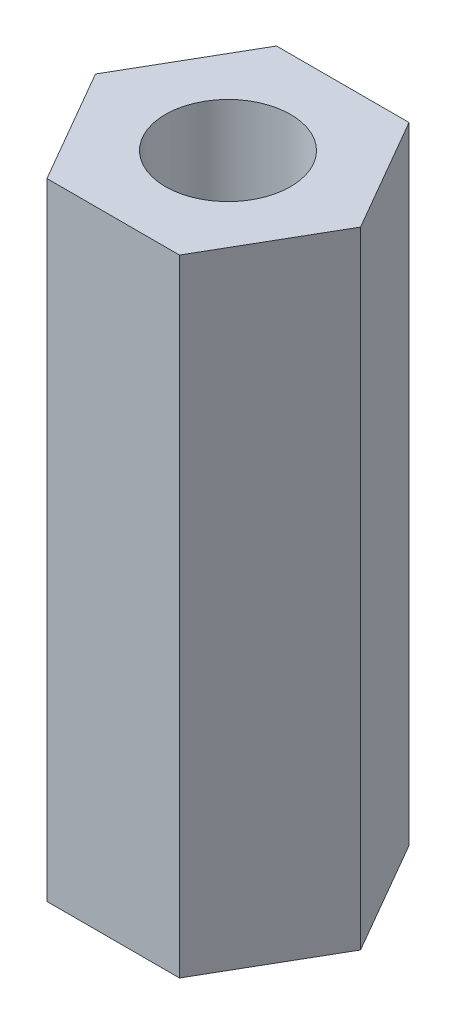
ISO-10303-21;
HEADER;
FILE_DESCRIPTION(('STEP AP214'),'2;1');
FILE_NAME('part.step','',(''),(''),'','','');
FILE_SCHEMA(('AUTOMOTIVE_DESIGN { 1 0 10303 214 1 1 1 1 }'));
ENDSEC;
DATA;
#1=APPLICATION_CONTEXT('core data for automotive mechanical design processes');
#2=APPLICATION_PROTOCOL_DEFINITION('international standard','automotive_design',2000,#1);
#3=PRODUCT_CONTEXT('',#1,'mechanical');
#4=PRODUCT('Part','Part','',(#3));
#5=PRODUCT_RELATED_PRODUCT_CATEGORY('part','',(#4));
#6=PRODUCT_DEFINITION_FORMATION('','',#4);
#7=PRODUCT_DEFINITION_CONTEXT('part definition',#1,'design');
#8=PRODUCT_DEFINITION('design','',#6,#7);
#9=PRODUCT_DEFINITION_SHAPE('','',#8);
#10=(LENGTH_UNIT() NAMED_UNIT(*) SI_UNIT(.MILLI.,.METRE.));
#11=(NAMED_UNIT(*) PLANE_ANGLE_UNIT() SI_UNIT($,.RADIAN.));
#12=(NAMED_UNIT(*) SI_UNIT($,.STERADIAN.) SOLID_ANGLE_UNIT());
#13=UNCERTAINTY_MEASURE_WITH_UNIT(LENGTH_MEASURE(1.E-05),#10,'distance_accuracy_value','');
#14=(GEOMETRIC_REPRESENTATION_CONTEXT(3) GLOBAL_UNCERTAINTY_ASSIGNED_CONTEXT((#13)) GLOBAL_UNIT_ASSIGNED_CONTEXT((#10,
#11,#12)) REPRESENTATION_CONTEXT('',''));
#15=CARTESIAN_POINT('',(0.,0.,0.));
#16=DIRECTION('',(0.,0.,1.));
#17=DIRECTION('',(1.,0.,0.));
#18=AXIS2_PLACEMENT_3D('',#15,#16,#17);
#19=CARTESIAN_POINT('',(0.,15.,0.));
#20=DIRECTION('',(0.,1.,0.));
#21=DIRECTION('',(0.,0.,1.));
#22=AXIS2_PLACEMENT_3D('',#19,#20,#21);
#23=PLANE('',#22);
#24=DIRECTION('',(-1.,0.,0.));
#25=VECTOR('',#24,1.);
#26=CARTESIAN_POINT('',(1.58771324027147,15.,-2.75));
#27=LINE('',#26,#25);
#28=CARTESIAN_POINT('',(1.58771324027147,15.,-2.75));
#29=VERTEX_POINT('',#28);
#30=CARTESIAN_POINT('',(-1.58771324027147,15.,-2.75));
#31=VERTEX_POINT('',#30);
#32=EDGE_CURVE('E133',#29,#31,#27,.T.);
#33=ORIENTED_EDGE('',*,*,#32,.T.);
#34=DIRECTION('',(-0.5,0.,0.866025403784438));
#35=VECTOR('',#34,1.);
#36=CARTESIAN_POINT('',(-1.58771324027147,15.,-2.75));
#37=LINE('',#36,#35);
#38=CARTESIAN_POINT('',(-3.17542648054294,15.,0.));
#39=VERTEX_POINT('',#38);
#40=EDGE_CURVE('E91',#31,#39,#37,.T.);
#41=ORIENTED_EDGE('',*,*,#40,.T.);
#42=DIRECTION('',(0.5,0.,0.866025403784439));
#43=VECTOR('',#42,1.);
#44=CARTESIAN_POINT('',(-3.17542648054294,15.,0.));
#45=LINE('',#44,#43);
#46=CARTESIAN_POINT('',(-1.58771324027147,15.,2.75));
#47=VERTEX_POINT('',#46);
#48=EDGE_CURVE('E104',#39,#47,#45,.T.);
#49=ORIENTED_EDGE('',*,*,#48,.T.);
#50=DIRECTION('',(1.,0.,0.));
#51=VECTOR('',#50,1.);
#52=CARTESIAN_POINT('',(-1.58771324027147,15.,2.75));
#53=LINE('',#52,#51);
#54=CARTESIAN_POINT('',(1.58771324027147,15.,2.75));
#55=VERTEX_POINT('',#54);
#56=EDGE_CURVE('E98',#47,#55,#53,.T.);
#57=ORIENTED_EDGE('',*,*,#56,.T.);
#58=DIRECTION('',(0.5,0.,-0.866025403784439));
#59=VECTOR('',#58,1.);
#60=CARTESIAN_POINT('',(1.58771324027147,15.,2.75));
#61=LINE('',#60,#59);
#62=CARTESIAN_POINT('',(3.17542648054294,15.,0.));
#63=VERTEX_POINT('',#62);
#64=EDGE_CURVE('E102',#55,#63,#61,.T.);
#65=ORIENTED_EDGE('',*,*,#64,.T.);
#66=DIRECTION('',(-0.5,0.,-0.866025403784439));
#67=VECTOR('',#66,1.);
#68=CARTESIAN_POINT('',(3.17542648054294,15.,0.));
#69=LINE('',#68,#67);
#70=EDGE_CURVE('E54',#63,#29,#69,.T.);
#71=ORIENTED_EDGE('',*,*,#70,.T.);
#72=EDGE_LOOP('',(#33,#41,#49,#57,#65,#71));
#73=FACE_BOUND('',#72,.T.);
#74=CARTESIAN_POINT('',(0.,15.,0.));
#75=DIRECTION('',(0.,1.,0.));
#76=DIRECTION('',(0.,0.,1.));
#77=AXIS2_PLACEMENT_3D('',#74,#75,#76);
#78=CIRCLE('',#77,1.5);
#79=CARTESIAN_POINT('',(0.,15.,1.5));
#80=VERTEX_POINT('',#79);
#81=EDGE_CURVE('E126',#80,#80,#78,.T.);
#82=ORIENTED_EDGE('',*,*,#81,.F.);
#83=EDGE_LOOP('',(#82));
#84=FACE_BOUND('',#83,.T.);
#85=ADVANCED_FACE('F37',(#73,#84),#23,.T.);
#86=CARTESIAN_POINT('',(0.,0.,0.));
#87=DIRECTION('',(0.,1.,0.));
#88=DIRECTION('',(0.,0.,1.));
#89=AXIS2_PLACEMENT_3D('',#86,#87,#88);
#90=PLANE('',#89);
#91=DIRECTION('',(-1.,0.,0.));
#92=VECTOR('',#91,1.);
#93=CARTESIAN_POINT('',(1.58771324027147,0.,-2.75));
#94=LINE('',#93,#92);
#95=CARTESIAN_POINT('',(1.58771324027147,0.,-2.75));
#96=VERTEX_POINT('',#95);
#97=CARTESIAN_POINT('',(-1.58771324027147,0.,-2.75));
#98=VERTEX_POINT('',#97);
#99=EDGE_CURVE('E122',#96,#98,#94,.T.);
#100=ORIENTED_EDGE('',*,*,#99,.F.);
#101=DIRECTION('',(-0.5,0.,-0.866025403784439));
#102=VECTOR('',#101,1.);
#103=CARTESIAN_POINT('',(3.17542648054294,0.,0.));
#104=LINE('',#103,#102);
#105=CARTESIAN_POINT('',(3.17542648054294,0.,0.));
#106=VERTEX_POINT('',#105);
#107=EDGE_CURVE('E83',#106,#96,#104,.T.);
#108=ORIENTED_EDGE('',*,*,#107,.F.);
#109=DIRECTION('',(0.5,0.,-0.866025403784439));
#110=VECTOR('',#109,1.);
#111=CARTESIAN_POINT('',(1.58771324027147,0.,2.75));
#112=LINE('',#111,#110);
#113=CARTESIAN_POINT('',(1.58771324027147,0.,2.75));
#114=VERTEX_POINT('',#113);
#115=EDGE_CURVE('E77',#114,#106,#112,.T.);
#116=ORIENTED_EDGE('',*,*,#115,.F.);
#117=DIRECTION('',(1.,0.,0.));
#118=VECTOR('',#117,1.);
#119=CARTESIAN_POINT('',(-1.58771324027147,0.,2.75));
#120=LINE('',#119,#118);
#121=CARTESIAN_POINT('',(-1.58771324027147,0.,2.75));
#122=VERTEX_POINT('',#121);
#123=EDGE_CURVE('E112',#122,#114,#120,.T.);
#124=ORIENTED_EDGE('',*,*,#123,.F.);
#125=DIRECTION('',(0.5,0.,0.866025403784439));
#126=VECTOR('',#125,1.);
#127=CARTESIAN_POINT('',(-3.17542648054294,0.,0.));
#128=LINE('',#127,#126);
#129=CARTESIAN_POINT('',(-3.17542648054294,0.,0.));
#130=VERTEX_POINT('',#129);
#131=EDGE_CURVE('E128',#130,#122,#128,.T.);
#132=ORIENTED_EDGE('',*,*,#131,.F.);
#133=DIRECTION('',(-0.5,0.,0.866025403784438));
#134=VECTOR('',#133,1.);
#135=CARTESIAN_POINT('',(-1.58771324027147,0.,-2.75));
#136=LINE('',#135,#134);
#137=EDGE_CURVE('E125',#98,#130,#136,.T.);
#138=ORIENTED_EDGE('',*,*,#137,.F.);
#139=EDGE_LOOP('',(#100,#108,#116,#124,#132,#138));
#140=FACE_BOUND('',#139,.T.);
#141=CARTESIAN_POINT('',(0.,0.,0.));
#142=DIRECTION('',(0.,1.,0.));
#143=DIRECTION('',(0.,0.,1.));
#144=AXIS2_PLACEMENT_3D('',#141,#142,#143);
#145=CIRCLE('',#144,1.5);
#146=CARTESIAN_POINT('',(0.,0.,1.5));
#147=VERTEX_POINT('',#146);
#148=EDGE_CURVE('E226',#147,#147,#145,.T.);
#149=ORIENTED_EDGE('',*,*,#148,.T.);
#150=EDGE_LOOP('',(#149));
#151=FACE_BOUND('',#150,.T.);
#152=ADVANCED_FACE('F142',(#140,#151),#90,.F.);
#153=CARTESIAN_POINT('',(1.58771324027147,15.,-2.75));
#154=DIRECTION('',(0.,0.,1.));
#155=DIRECTION('',(1.,0.,0.));
#156=AXIS2_PLACEMENT_3D('',#153,#154,#155);
#157=PLANE('',#156);
#158=ORIENTED_EDGE('',*,*,#99,.T.);
#159=DIRECTION('',(0.,-1.,0.));
#160=VECTOR('',#159,1.);
#161=CARTESIAN_POINT('',(-1.58771324027147,15.,-2.75));
#162=LINE('',#161,#160);
#163=EDGE_CURVE('E11',#31,#98,#162,.T.);
#164=ORIENTED_EDGE('',*,*,#163,.F.);
#165=ORIENTED_EDGE('',*,*,#32,.F.);
#166=DIRECTION('',(0.,-1.,0.));
#167=VECTOR('',#166,1.);
#168=CARTESIAN_POINT('',(1.58771324027147,15.,-2.75));
#169=LINE('',#168,#167);
#170=EDGE_CURVE('E118',#29,#96,#169,.T.);
#171=ORIENTED_EDGE('',*,*,#170,.T.);
#172=EDGE_LOOP('',(#158,#164,#165,#171));
#173=FACE_BOUND('',#172,.T.);
#174=ADVANCED_FACE('F39',(#173),#157,.F.);
#175=CARTESIAN_POINT('',(-1.58771324027147,15.,-2.75));
#176=DIRECTION('',(0.866025403784438,0.,0.5));
#177=DIRECTION('',(0.5,0.,-0.866025403784438));
#178=AXIS2_PLACEMENT_3D('',#175,#176,#177);
#179=PLANE('',#178);
#180=ORIENTED_EDGE('',*,*,#137,.T.);
#181=DIRECTION('',(0.,-1.,0.));
#182=VECTOR('',#181,1.);
#183=CARTESIAN_POINT('',(-3.17542648054294,15.,0.));
#184=LINE('',#183,#182);
#185=EDGE_CURVE('E46',#39,#130,#184,.T.);
#186=ORIENTED_EDGE('',*,*,#185,.F.);
#187=ORIENTED_EDGE('',*,*,#40,.F.);
#188=ORIENTED_EDGE('',*,*,#163,.T.);
#189=EDGE_LOOP('',(#180,#186,#187,#188));
#190=FACE_BOUND('',#189,.T.);
#191=ADVANCED_FACE('F167',(#190),#179,.F.);
#192=CARTESIAN_POINT('',(-3.17542648054294,15.,0.));
#193=DIRECTION('',(0.866025403784439,0.,-0.5));
#194=DIRECTION('',(-0.5,0.,-0.866025403784439));
#195=AXIS2_PLACEMENT_3D('',#192,#193,#194);
#196=PLANE('',#195);
#197=ORIENTED_EDGE('',*,*,#131,.T.);
#198=DIRECTION('',(0.,-1.,0.));
#199=VECTOR('',#198,1.);
#200=CARTESIAN_POINT('',(-1.58771324027147,15.,2.75));
#201=LINE('',#200,#199);
#202=EDGE_CURVE('E113',#47,#122,#201,.T.);
#203=ORIENTED_EDGE('',*,*,#202,.F.);
#204=ORIENTED_EDGE('',*,*,#48,.F.);
#205=ORIENTED_EDGE('',*,*,#185,.T.);
#206=EDGE_LOOP('',(#197,#203,#204,#205));
#207=FACE_BOUND('',#206,.T.);
#208=ADVANCED_FACE('F139',(#207),#196,.F.);
#209=CARTESIAN_POINT('',(-1.58771324027147,15.,2.75));
#210=DIRECTION('',(0.,0.,-1.));
#211=DIRECTION('',(-1.,0.,0.));
#212=AXIS2_PLACEMENT_3D('',#209,#210,#211);
#213=PLANE('',#212);
#214=ORIENTED_EDGE('',*,*,#123,.T.);
#215=DIRECTION('',(0.,-1.,0.));
#216=VECTOR('',#215,1.);
#217=CARTESIAN_POINT('',(1.58771324027147,15.,2.75));
#218=LINE('',#217,#216);
#219=EDGE_CURVE('E109',#55,#114,#218,.T.);
#220=ORIENTED_EDGE('',*,*,#219,.F.);
#221=ORIENTED_EDGE('',*,*,#56,.F.);
#222=ORIENTED_EDGE('',*,*,#202,.T.);
#223=EDGE_LOOP('',(#214,#220,#221,#222));
#224=FACE_BOUND('',#223,.T.);
#225=ADVANCED_FACE('F110',(#224),#213,.F.);
#226=CARTESIAN_POINT('',(1.58771324027147,15.,2.75));
#227=DIRECTION('',(-0.866025403784439,0.,-0.5));
#228=DIRECTION('',(-0.5,0.,0.866025403784439));
#229=AXIS2_PLACEMENT_3D('',#226,#227,#228);
#230=PLANE('',#229);
#231=ORIENTED_EDGE('',*,*,#115,.T.);
#232=DIRECTION('',(0.,-1.,0.));
#233=VECTOR('',#232,1.);
#234=CARTESIAN_POINT('',(3.17542648054294,15.,0.));
#235=LINE('',#234,#233);
#236=EDGE_CURVE('E114',#63,#106,#235,.T.);
#237=ORIENTED_EDGE('',*,*,#236,.F.);
#238=ORIENTED_EDGE('',*,*,#64,.F.);
#239=ORIENTED_EDGE('',*,*,#219,.T.);
#240=EDGE_LOOP('',(#231,#237,#238,#239));
#241=FACE_BOUND('',#240,.T.);
#242=ADVANCED_FACE('F116',(#241),#230,.F.);
#243=CARTESIAN_POINT('',(3.17542648054294,15.,0.));
#244=DIRECTION('',(-0.866025403784439,0.,0.5));
#245=DIRECTION('',(0.5,0.,0.866025403784439));
#246=AXIS2_PLACEMENT_3D('',#243,#244,#245);
#247=PLANE('',#246);
#248=ORIENTED_EDGE('',*,*,#107,.T.);
#249=ORIENTED_EDGE('',*,*,#170,.F.);
#250=ORIENTED_EDGE('',*,*,#70,.F.);
#251=ORIENTED_EDGE('',*,*,#236,.T.);
#252=EDGE_LOOP('',(#248,#249,#250,#251));
#253=FACE_BOUND('',#252,.T.);
#254=ADVANCED_FACE('F147',(#253),#247,.F.);
#255=CARTESIAN_POINT('',(0.,15.,0.));
#256=DIRECTION('',(0.,-1.,0.));
#257=DIRECTION('',(0.,0.,-1.));
#258=AXIS2_PLACEMENT_3D('',#255,#256,#257);
#259=CYLINDRICAL_SURFACE('',#258,1.5);
#260=ORIENTED_EDGE('',*,*,#81,.T.);
#261=EDGE_LOOP('',(#260));
#262=FACE_BOUND('',#261,.T.);
#263=ORIENTED_EDGE('',*,*,#148,.F.);
#264=EDGE_LOOP('',(#263));
#265=FACE_BOUND('',#264,.T.);
#266=ADVANCED_FACE('F149',(#262,#265),#259,.F.);
#267=CLOSED_SHELL('',(#85,#152,#174,#191,#208,#225,#242,#254,#266));
#268=MANIFOLD_SOLID_BREP('B2',#267);
#269=ADVANCED_BREP_SHAPE_REPRESENTATION('',(#18,#268),#14);
#270=SHAPE_DEFINITION_REPRESENTATION(#9,#269);
ENDSEC;
END-ISO-10303-21;
